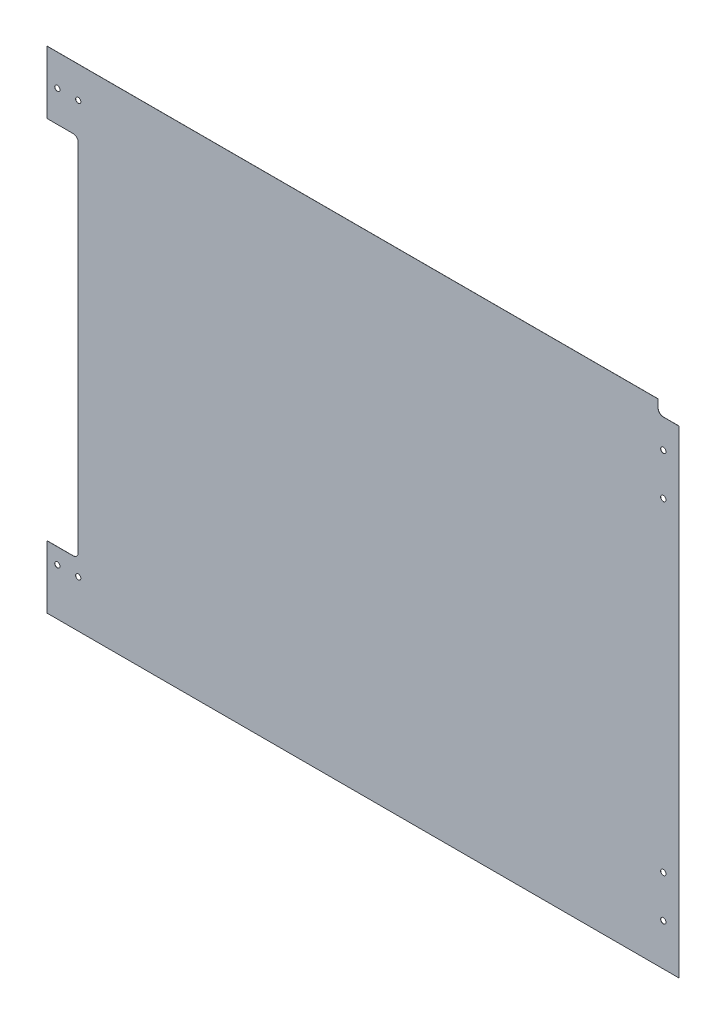
ISO-10303-21;
HEADER;
FILE_DESCRIPTION(('STEP AP214'),'2;1');
FILE_NAME('part.step','',(''),(''),'','','');
FILE_SCHEMA(('AUTOMOTIVE_DESIGN { 1 0 10303 214 1 1 1 1 }'));
ENDSEC;
DATA;
#1=APPLICATION_CONTEXT('core data for automotive mechanical design processes');
#2=APPLICATION_PROTOCOL_DEFINITION('international standard','automotive_design',2000,#1);
#3=PRODUCT_CONTEXT('',#1,'mechanical');
#4=PRODUCT('Part','Part','',(#3));
#5=PRODUCT_RELATED_PRODUCT_CATEGORY('part','',(#4));
#6=PRODUCT_DEFINITION_FORMATION('','',#4);
#7=PRODUCT_DEFINITION_CONTEXT('part definition',#1,'design');
#8=PRODUCT_DEFINITION('design','',#6,#7);
#9=PRODUCT_DEFINITION_SHAPE('','',#8);
#10=(LENGTH_UNIT() NAMED_UNIT(*) SI_UNIT(.MILLI.,.METRE.));
#11=(NAMED_UNIT(*) PLANE_ANGLE_UNIT() SI_UNIT($,.RADIAN.));
#12=(NAMED_UNIT(*) SI_UNIT($,.STERADIAN.) SOLID_ANGLE_UNIT());
#13=UNCERTAINTY_MEASURE_WITH_UNIT(LENGTH_MEASURE(1.E-05),#10,'distance_accuracy_value','');
#14=(GEOMETRIC_REPRESENTATION_CONTEXT(3) GLOBAL_UNCERTAINTY_ASSIGNED_CONTEXT((#13)) GLOBAL_UNIT_ASSIGNED_CONTEXT((#10,
#11,#12)) REPRESENTATION_CONTEXT('',''));
#15=CARTESIAN_POINT('',(0.,0.,0.));
#16=DIRECTION('',(0.,0.,1.));
#17=DIRECTION('',(1.,0.,0.));
#18=AXIS2_PLACEMENT_3D('',#15,#16,#17);
#19=CARTESIAN_POINT('',(0.,0.,0.127));
#20=DIRECTION('',(0.,0.,-1.));
#21=DIRECTION('',(-1.,0.,0.));
#22=AXIS2_PLACEMENT_3D('',#19,#20,#21);
#23=PLANE('',#22);
#24=CARTESIAN_POINT('',(-387.35,260.35,0.127000000000001));
#25=DIRECTION('',(0.,0.,1.));
#26=DIRECTION('',(1.,0.,0.));
#27=AXIS2_PLACEMENT_3D('',#24,#25,#26);
#28=CIRCLE('',#27,3.17499999999998);
#29=CARTESIAN_POINT('',(-384.175,260.35,0.127000000000001));
#30=VERTEX_POINT('',#29);
#31=EDGE_CURVE('E160',#30,#30,#28,.T.);
#32=ORIENTED_EDGE('',*,*,#31,.F.);
#33=EDGE_LOOP('',(#32));
#34=FACE_BOUND('',#33,.T.);
#35=CARTESIAN_POINT('',(-387.35,-241.3,0.127000000000001));
#36=DIRECTION('',(0.,0.,1.));
#37=DIRECTION('',(1.,0.,0.));
#38=AXIS2_PLACEMENT_3D('',#35,#36,#37);
#39=CIRCLE('',#38,3.17499999999998);
#40=CARTESIAN_POINT('',(-384.175,-241.3,0.127000000000001));
#41=VERTEX_POINT('',#40);
#42=EDGE_CURVE('E180',#41,#41,#39,.T.);
#43=ORIENTED_EDGE('',*,*,#42,.F.);
#44=EDGE_LOOP('',(#43));
#45=FACE_BOUND('',#44,.T.);
#46=CARTESIAN_POINT('',(349.25,247.65,0.127));
#47=DIRECTION('',(0.,0.,1.));
#48=DIRECTION('',(1.,0.,0.));
#49=AXIS2_PLACEMENT_3D('',#46,#47,#48);
#50=CIRCLE('',#49,3.26389999999999);
#51=CARTESIAN_POINT('',(352.5139,247.65,0.127));
#52=VERTEX_POINT('',#51);
#53=EDGE_CURVE('E186',#52,#52,#50,.T.);
#54=ORIENTED_EDGE('',*,*,#53,.F.);
#55=EDGE_LOOP('',(#54));
#56=FACE_BOUND('',#55,.T.);
#57=CARTESIAN_POINT('',(349.25,196.85,0.127));
#58=DIRECTION('',(0.,0.,1.));
#59=DIRECTION('',(1.,0.,0.));
#60=AXIS2_PLACEMENT_3D('',#57,#58,#59);
#61=CIRCLE('',#60,3.26389999999999);
#62=CARTESIAN_POINT('',(352.5139,196.85,0.127));
#63=VERTEX_POINT('',#62);
#64=EDGE_CURVE('E192',#63,#63,#61,.T.);
#65=ORIENTED_EDGE('',*,*,#64,.F.);
#66=EDGE_LOOP('',(#65));
#67=FACE_BOUND('',#66,.T.);
#68=CARTESIAN_POINT('',(349.25,-196.85,0.127));
#69=DIRECTION('',(0.,0.,1.));
#70=DIRECTION('',(1.,0.,0.));
#71=AXIS2_PLACEMENT_3D('',#68,#69,#70);
#72=CIRCLE('',#71,3.26389999999999);
#73=CARTESIAN_POINT('',(352.5139,-196.85,0.127));
#74=VERTEX_POINT('',#73);
#75=EDGE_CURVE('E198',#74,#74,#72,.T.);
#76=ORIENTED_EDGE('',*,*,#75,.F.);
#77=EDGE_LOOP('',(#76));
#78=FACE_BOUND('',#77,.T.);
#79=CARTESIAN_POINT('',(349.25,-247.65,0.127));
#80=DIRECTION('',(0.,0.,1.));
#81=DIRECTION('',(1.,0.,0.));
#82=AXIS2_PLACEMENT_3D('',#79,#80,#81);
#83=CIRCLE('',#82,3.26389999999999);
#84=CARTESIAN_POINT('',(352.5139,-247.65,0.127));
#85=VERTEX_POINT('',#84);
#86=EDGE_CURVE('E204',#85,#85,#83,.T.);
#87=ORIENTED_EDGE('',*,*,#86,.F.);
#88=EDGE_LOOP('',(#87));
#89=FACE_BOUND('',#88,.T.);
#90=DIRECTION('',(0.,1.,0.));
#91=VECTOR('',#90,1.);
#92=CARTESIAN_POINT('',(368.3,-298.45,0.127));
#93=LINE('',#92,#91);
#94=CARTESIAN_POINT('',(368.3,-298.45,0.127));
#95=VERTEX_POINT('',#94);
#96=CARTESIAN_POINT('',(368.3,282.575,0.127));
#97=VERTEX_POINT('',#96);
#98=EDGE_CURVE('E250',#95,#97,#93,.T.);
#99=ORIENTED_EDGE('',*,*,#98,.T.);
#100=DIRECTION('',(1.,0.,0.));
#101=VECTOR('',#100,1.);
#102=CARTESIAN_POINT('',(368.3,282.575,0.127));
#103=LINE('',#102,#101);
#104=CARTESIAN_POINT('',(349.25,282.575,0.127));
#105=VERTEX_POINT('',#104);
#106=EDGE_CURVE('E149',#105,#97,#103,.T.);
#107=ORIENTED_EDGE('',*,*,#106,.F.);
#108=CARTESIAN_POINT('',(349.25,288.925,0.127));
#109=DIRECTION('',(0.,0.,1.));
#110=DIRECTION('',(-1.,0.,0.));
#111=AXIS2_PLACEMENT_3D('',#108,#109,#110);
#112=CIRCLE('',#111,6.35000000000002);
#113=CARTESIAN_POINT('',(342.9,288.925,0.127));
#114=VERTEX_POINT('',#113);
#115=EDGE_CURVE('E151',#114,#105,#112,.T.);
#116=ORIENTED_EDGE('',*,*,#115,.F.);
#117=DIRECTION('',(0.,-1.,0.));
#118=VECTOR('',#117,1.);
#119=CARTESIAN_POINT('',(342.9,298.45,0.127));
#120=LINE('',#119,#118);
#121=CARTESIAN_POINT('',(342.9,298.45,0.127));
#122=VERTEX_POINT('',#121);
#123=EDGE_CURVE('E129',#122,#114,#120,.T.);
#124=ORIENTED_EDGE('',*,*,#123,.F.);
#125=DIRECTION('',(-1.,0.,0.));
#126=VECTOR('',#125,1.);
#127=CARTESIAN_POINT('',(-368.3,298.45,0.127));
#128=LINE('',#127,#126);
#129=CARTESIAN_POINT('',(-400.05,298.45,0.127));
#130=VERTEX_POINT('',#129);
#131=EDGE_CURVE('E253',#122,#130,#128,.T.);
#132=ORIENTED_EDGE('',*,*,#131,.T.);
#133=DIRECTION('',(0.,-1.,0.));
#134=VECTOR('',#133,1.);
#135=CARTESIAN_POINT('',(-400.05,298.45,0.127));
#136=LINE('',#135,#134);
#137=CARTESIAN_POINT('',(-400.05,222.25,0.127));
#138=VERTEX_POINT('',#137);
#139=EDGE_CURVE('E230',#130,#138,#136,.T.);
#140=ORIENTED_EDGE('',*,*,#139,.T.);
#141=DIRECTION('',(1.,0.,0.));
#142=VECTOR('',#141,1.);
#143=CARTESIAN_POINT('',(-368.3,222.25,0.127));
#144=LINE('',#143,#142);
#145=CARTESIAN_POINT('',(-368.3,222.25,0.127));
#146=VERTEX_POINT('',#145);
#147=EDGE_CURVE('E233',#138,#146,#144,.T.);
#148=ORIENTED_EDGE('',*,*,#147,.T.);
#149=CARTESIAN_POINT('',(-368.3,215.9,0.127000000000002));
#150=DIRECTION('',(0.,0.,-1.));
#151=DIRECTION('',(-1.,0.,0.));
#152=AXIS2_PLACEMENT_3D('',#149,#150,#151);
#153=CIRCLE('',#152,6.35);
#154=CARTESIAN_POINT('',(-361.95,215.9,0.127));
#155=VERTEX_POINT('',#154);
#156=EDGE_CURVE('E274',#146,#155,#153,.T.);
#157=ORIENTED_EDGE('',*,*,#156,.T.);
#158=DIRECTION('',(0.,1.,0.));
#159=VECTOR('',#158,1.);
#160=CARTESIAN_POINT('',(-361.95,222.25,0.127));
#161=LINE('',#160,#159);
#162=CARTESIAN_POINT('',(-361.95,-215.9,0.127));
#163=VERTEX_POINT('',#162);
#164=EDGE_CURVE('E210',#163,#155,#161,.T.);
#165=ORIENTED_EDGE('',*,*,#164,.F.);
#166=CARTESIAN_POINT('',(-368.3,-215.9,0.127));
#167=DIRECTION('',(0.,0.,-1.));
#168=DIRECTION('',(-1.,0.,0.));
#169=AXIS2_PLACEMENT_3D('',#166,#167,#168);
#170=CIRCLE('',#169,6.35);
#171=CARTESIAN_POINT('',(-368.3,-222.25,0.127));
#172=VERTEX_POINT('',#171);
#173=EDGE_CURVE('E40',#163,#172,#170,.T.);
#174=ORIENTED_EDGE('',*,*,#173,.T.);
#175=DIRECTION('',(-1.,0.,0.));
#176=VECTOR('',#175,1.);
#177=CARTESIAN_POINT('',(-368.3,-222.25,0.127));
#178=LINE('',#177,#176);
#179=CARTESIAN_POINT('',(-400.05,-222.25,0.127));
#180=VERTEX_POINT('',#179);
#181=EDGE_CURVE('E214',#172,#180,#178,.T.);
#182=ORIENTED_EDGE('',*,*,#181,.T.);
#183=DIRECTION('',(0.,-1.,0.));
#184=VECTOR('',#183,1.);
#185=CARTESIAN_POINT('',(-400.05,-298.45,0.127));
#186=LINE('',#185,#184);
#187=CARTESIAN_POINT('',(-400.05,-298.45,0.127));
#188=VERTEX_POINT('',#187);
#189=EDGE_CURVE('E217',#180,#188,#186,.T.);
#190=ORIENTED_EDGE('',*,*,#189,.T.);
#191=DIRECTION('',(1.,0.,0.));
#192=VECTOR('',#191,1.);
#193=CARTESIAN_POINT('',(-368.3,-298.45,0.127));
#194=LINE('',#193,#192);
#195=EDGE_CURVE('E256',#188,#95,#194,.T.);
#196=ORIENTED_EDGE('',*,*,#195,.T.);
#197=EDGE_LOOP('',(#99,#107,#116,#124,#132,#140,#148,#157,#165,#174,#182,#190,#196));
#198=FACE_BOUND('',#197,.T.);
#199=CARTESIAN_POINT('',(-361.95,-241.3,0.127000000000001));
#200=DIRECTION('',(0.,0.,1.));
#201=DIRECTION('',(1.,0.,0.));
#202=AXIS2_PLACEMENT_3D('',#199,#200,#201);
#203=CIRCLE('',#202,3.17499999999998);
#204=CARTESIAN_POINT('',(-358.775,-241.3,0.127000000000001));
#205=VERTEX_POINT('',#204);
#206=EDGE_CURVE('E174',#205,#205,#203,.T.);
#207=ORIENTED_EDGE('',*,*,#206,.F.);
#208=EDGE_LOOP('',(#207));
#209=FACE_BOUND('',#208,.T.);
#210=CARTESIAN_POINT('',(-361.95,260.35,0.127000000000001));
#211=DIRECTION('',(0.,0.,1.));
#212=DIRECTION('',(1.,0.,0.));
#213=AXIS2_PLACEMENT_3D('',#210,#211,#212);
#214=CIRCLE('',#213,3.17499999999998);
#215=CARTESIAN_POINT('',(-358.775,260.35,0.127000000000001));
#216=VERTEX_POINT('',#215);
#217=EDGE_CURVE('E168',#216,#216,#214,.T.);
#218=ORIENTED_EDGE('',*,*,#217,.F.);
#219=EDGE_LOOP('',(#218));
#220=FACE_BOUND('',#219,.T.);
#221=ADVANCED_FACE('F32',(#34,#45,#56,#67,#78,#89,#198,#209,#220),#23,.F.);
#222=CARTESIAN_POINT('',(0.,0.,0.));
#223=DIRECTION('',(0.,0.,-1.));
#224=DIRECTION('',(-1.,0.,0.));
#225=AXIS2_PLACEMENT_3D('',#222,#223,#224);
#226=PLANE('',#225);
#227=DIRECTION('',(1.,0.,0.));
#228=VECTOR('',#227,1.);
#229=CARTESIAN_POINT('',(368.3,282.575,0.));
#230=LINE('',#229,#228);
#231=CARTESIAN_POINT('',(349.25,282.575,0.));
#232=VERTEX_POINT('',#231);
#233=CARTESIAN_POINT('',(368.3,282.575,0.));
#234=VERTEX_POINT('',#233);
#235=EDGE_CURVE('E142',#232,#234,#230,.T.);
#236=ORIENTED_EDGE('',*,*,#235,.T.);
#237=DIRECTION('',(0.,1.,0.));
#238=VECTOR('',#237,1.);
#239=CARTESIAN_POINT('',(368.3,-298.45,0.));
#240=LINE('',#239,#238);
#241=CARTESIAN_POINT('',(368.3,-298.45,0.));
#242=VERTEX_POINT('',#241);
#243=EDGE_CURVE('E242',#242,#234,#240,.T.);
#244=ORIENTED_EDGE('',*,*,#243,.F.);
#245=DIRECTION('',(1.,0.,0.));
#246=VECTOR('',#245,1.);
#247=CARTESIAN_POINT('',(-368.3,-298.45,0.));
#248=LINE('',#247,#246);
#249=CARTESIAN_POINT('',(-400.05,-298.45,0.));
#250=VERTEX_POINT('',#249);
#251=EDGE_CURVE('E254',#250,#242,#248,.T.);
#252=ORIENTED_EDGE('',*,*,#251,.F.);
#253=DIRECTION('',(0.,-1.,0.));
#254=VECTOR('',#253,1.);
#255=CARTESIAN_POINT('',(-400.05,-298.45,0.));
#256=LINE('',#255,#254);
#257=CARTESIAN_POINT('',(-400.05,-222.25,0.));
#258=VERTEX_POINT('',#257);
#259=EDGE_CURVE('E224',#258,#250,#256,.T.);
#260=ORIENTED_EDGE('',*,*,#259,.F.);
#261=DIRECTION('',(-1.,0.,0.));
#262=VECTOR('',#261,1.);
#263=CARTESIAN_POINT('',(-368.3,-222.25,0.));
#264=LINE('',#263,#262);
#265=CARTESIAN_POINT('',(-368.3,-222.25,0.));
#266=VERTEX_POINT('',#265);
#267=EDGE_CURVE('E220',#266,#258,#264,.T.);
#268=ORIENTED_EDGE('',*,*,#267,.F.);
#269=CARTESIAN_POINT('',(-368.3,-215.9,0.));
#270=DIRECTION('',(0.,0.,-1.));
#271=DIRECTION('',(-1.,0.,0.));
#272=AXIS2_PLACEMENT_3D('',#269,#270,#271);
#273=CIRCLE('',#272,6.35);
#274=CARTESIAN_POINT('',(-361.95,-215.9,0.));
#275=VERTEX_POINT('',#274);
#276=EDGE_CURVE('E11',#266,#275,#273,.F.);
#277=ORIENTED_EDGE('',*,*,#276,.T.);
#278=DIRECTION('',(0.,1.,0.));
#279=VECTOR('',#278,1.);
#280=CARTESIAN_POINT('',(-361.95,222.25,0.));
#281=LINE('',#280,#279);
#282=CARTESIAN_POINT('',(-361.95,215.9,0.));
#283=VERTEX_POINT('',#282);
#284=EDGE_CURVE('E211',#275,#283,#281,.T.);
#285=ORIENTED_EDGE('',*,*,#284,.T.);
#286=CARTESIAN_POINT('',(-368.3,215.9,0.));
#287=DIRECTION('',(0.,0.,-1.));
#288=DIRECTION('',(-1.,0.,0.));
#289=AXIS2_PLACEMENT_3D('',#286,#287,#288);
#290=CIRCLE('',#289,6.35);
#291=CARTESIAN_POINT('',(-368.3,222.25,0.));
#292=VERTEX_POINT('',#291);
#293=EDGE_CURVE('E276',#283,#292,#290,.F.);
#294=ORIENTED_EDGE('',*,*,#293,.T.);
#295=DIRECTION('',(1.,0.,0.));
#296=VECTOR('',#295,1.);
#297=CARTESIAN_POINT('',(-368.3,222.25,0.));
#298=LINE('',#297,#296);
#299=CARTESIAN_POINT('',(-400.05,222.25,0.));
#300=VERTEX_POINT('',#299);
#301=EDGE_CURVE('E239',#300,#292,#298,.T.);
#302=ORIENTED_EDGE('',*,*,#301,.F.);
#303=DIRECTION('',(0.,-1.,0.));
#304=VECTOR('',#303,1.);
#305=CARTESIAN_POINT('',(-400.05,298.45,0.));
#306=LINE('',#305,#304);
#307=CARTESIAN_POINT('',(-400.05,298.45,0.));
#308=VERTEX_POINT('',#307);
#309=EDGE_CURVE('E244',#308,#300,#306,.T.);
#310=ORIENTED_EDGE('',*,*,#309,.F.);
#311=DIRECTION('',(-1.,0.,0.));
#312=VECTOR('',#311,1.);
#313=CARTESIAN_POINT('',(-368.3,298.45,0.));
#314=LINE('',#313,#312);
#315=CARTESIAN_POINT('',(342.9,298.45,0.));
#316=VERTEX_POINT('',#315);
#317=EDGE_CURVE('E148',#316,#308,#314,.T.);
#318=ORIENTED_EDGE('',*,*,#317,.F.);
#319=DIRECTION('',(0.,-1.,0.));
#320=VECTOR('',#319,1.);
#321=CARTESIAN_POINT('',(342.9,298.45,0.));
#322=LINE('',#321,#320);
#323=CARTESIAN_POINT('',(342.9,288.925,0.));
#324=VERTEX_POINT('',#323);
#325=EDGE_CURVE('E47',#316,#324,#322,.T.);
#326=ORIENTED_EDGE('',*,*,#325,.T.);
#327=CARTESIAN_POINT('',(349.25,288.925,0.));
#328=DIRECTION('',(0.,0.,1.));
#329=DIRECTION('',(-1.,0.,0.));
#330=AXIS2_PLACEMENT_3D('',#327,#328,#329);
#331=CIRCLE('',#330,6.35000000000002);
#332=EDGE_CURVE('E137',#324,#232,#331,.T.);
#333=ORIENTED_EDGE('',*,*,#332,.T.);
#334=EDGE_LOOP('',(#236,#244,#252,#260,#268,#277,#285,#294,#302,#310,#318,#326,#333));
#335=FACE_BOUND('',#334,.T.);
#336=CARTESIAN_POINT('',(-387.35,260.35,0.));
#337=DIRECTION('',(0.,0.,-1.));
#338=DIRECTION('',(-1.,0.,0.));
#339=AXIS2_PLACEMENT_3D('',#336,#337,#338);
#340=CIRCLE('',#339,3.17499999999998);
#341=CARTESIAN_POINT('',(-390.525,260.35,0.));
#342=VERTEX_POINT('',#341);
#343=EDGE_CURVE('E165',#342,#342,#340,.F.);
#344=ORIENTED_EDGE('',*,*,#343,.T.);
#345=EDGE_LOOP('',(#344));
#346=FACE_BOUND('',#345,.T.);
#347=CARTESIAN_POINT('',(-361.95,260.35,0.));
#348=DIRECTION('',(0.,0.,-1.));
#349=DIRECTION('',(-1.,0.,0.));
#350=AXIS2_PLACEMENT_3D('',#347,#348,#349);
#351=CIRCLE('',#350,3.17499999999998);
#352=CARTESIAN_POINT('',(-365.125,260.35,0.));
#353=VERTEX_POINT('',#352);
#354=EDGE_CURVE('E171',#353,#353,#351,.F.);
#355=ORIENTED_EDGE('',*,*,#354,.T.);
#356=EDGE_LOOP('',(#355));
#357=FACE_BOUND('',#356,.T.);
#358=CARTESIAN_POINT('',(-361.95,-241.3,0.));
#359=DIRECTION('',(0.,0.,-1.));
#360=DIRECTION('',(-1.,0.,0.));
#361=AXIS2_PLACEMENT_3D('',#358,#359,#360);
#362=CIRCLE('',#361,3.17499999999998);
#363=CARTESIAN_POINT('',(-365.125,-241.3,0.));
#364=VERTEX_POINT('',#363);
#365=EDGE_CURVE('E177',#364,#364,#362,.F.);
#366=ORIENTED_EDGE('',*,*,#365,.T.);
#367=EDGE_LOOP('',(#366));
#368=FACE_BOUND('',#367,.T.);
#369=CARTESIAN_POINT('',(-387.35,-241.3,0.));
#370=DIRECTION('',(0.,0.,-1.));
#371=DIRECTION('',(-1.,0.,0.));
#372=AXIS2_PLACEMENT_3D('',#369,#370,#371);
#373=CIRCLE('',#372,3.17499999999998);
#374=CARTESIAN_POINT('',(-390.525,-241.3,0.));
#375=VERTEX_POINT('',#374);
#376=EDGE_CURVE('E183',#375,#375,#373,.F.);
#377=ORIENTED_EDGE('',*,*,#376,.T.);
#378=EDGE_LOOP('',(#377));
#379=FACE_BOUND('',#378,.T.);
#380=CARTESIAN_POINT('',(349.25,247.65,0.));
#381=DIRECTION('',(0.,0.,1.));
#382=DIRECTION('',(1.,0.,0.));
#383=AXIS2_PLACEMENT_3D('',#380,#381,#382);
#384=CIRCLE('',#383,3.26389999999999);
#385=CARTESIAN_POINT('',(352.5139,247.65,0.));
#386=VERTEX_POINT('',#385);
#387=EDGE_CURVE('E189',#386,#386,#384,.T.);
#388=ORIENTED_EDGE('',*,*,#387,.T.);
#389=EDGE_LOOP('',(#388));
#390=FACE_BOUND('',#389,.T.);
#391=CARTESIAN_POINT('',(349.25,196.85,0.));
#392=DIRECTION('',(0.,0.,1.));
#393=DIRECTION('',(1.,0.,0.));
#394=AXIS2_PLACEMENT_3D('',#391,#392,#393);
#395=CIRCLE('',#394,3.26389999999999);
#396=CARTESIAN_POINT('',(352.5139,196.85,0.));
#397=VERTEX_POINT('',#396);
#398=EDGE_CURVE('E195',#397,#397,#395,.T.);
#399=ORIENTED_EDGE('',*,*,#398,.T.);
#400=EDGE_LOOP('',(#399));
#401=FACE_BOUND('',#400,.T.);
#402=CARTESIAN_POINT('',(349.25,-247.65,0.));
#403=DIRECTION('',(0.,0.,1.));
#404=DIRECTION('',(1.,0.,0.));
#405=AXIS2_PLACEMENT_3D('',#402,#403,#404);
#406=CIRCLE('',#405,3.26389999999999);
#407=CARTESIAN_POINT('',(352.5139,-247.65,0.));
#408=VERTEX_POINT('',#407);
#409=EDGE_CURVE('E207',#408,#408,#406,.T.);
#410=ORIENTED_EDGE('',*,*,#409,.T.);
#411=EDGE_LOOP('',(#410));
#412=FACE_BOUND('',#411,.T.);
#413=CARTESIAN_POINT('',(349.25,-196.85,0.));
#414=DIRECTION('',(0.,0.,1.));
#415=DIRECTION('',(1.,0.,0.));
#416=AXIS2_PLACEMENT_3D('',#413,#414,#415);
#417=CIRCLE('',#416,3.26389999999999);
#418=CARTESIAN_POINT('',(352.5139,-196.85,0.));
#419=VERTEX_POINT('',#418);
#420=EDGE_CURVE('E201',#419,#419,#417,.T.);
#421=ORIENTED_EDGE('',*,*,#420,.T.);
#422=EDGE_LOOP('',(#421));
#423=FACE_BOUND('',#422,.T.);
#424=ADVANCED_FACE('F145',(#335,#346,#357,#368,#379,#390,#401,#412,#423),#226,.T.);
#425=CARTESIAN_POINT('',(368.3,-298.45,0.127));
#426=DIRECTION('',(-1.,0.,0.));
#427=DIRECTION('',(0.,0.,1.));
#428=AXIS2_PLACEMENT_3D('',#425,#426,#427);
#429=PLANE('',#428);
#430=ORIENTED_EDGE('',*,*,#243,.T.);
#431=DIRECTION('',(0.,0.,1.));
#432=VECTOR('',#431,1.);
#433=CARTESIAN_POINT('',(368.3,282.575,0.));
#434=LINE('',#433,#432);
#435=EDGE_CURVE('E157',#234,#97,#434,.T.);
#436=ORIENTED_EDGE('',*,*,#435,.T.);
#437=ORIENTED_EDGE('',*,*,#98,.F.);
#438=DIRECTION('',(0.,0.,-1.));
#439=VECTOR('',#438,1.);
#440=CARTESIAN_POINT('',(368.3,-298.45,0.127));
#441=LINE('',#440,#439);
#442=EDGE_CURVE('E258',#95,#242,#441,.T.);
#443=ORIENTED_EDGE('',*,*,#442,.T.);
#444=EDGE_LOOP('',(#430,#436,#437,#443));
#445=FACE_BOUND('',#444,.T.);
#446=ADVANCED_FACE('F311',(#445),#429,.F.);
#447=CARTESIAN_POINT('',(-368.3,298.45,0.127));
#448=DIRECTION('',(0.,-1.,0.));
#449=DIRECTION('',(0.,0.,-1.));
#450=AXIS2_PLACEMENT_3D('',#447,#448,#449);
#451=PLANE('',#450);
#452=ORIENTED_EDGE('',*,*,#131,.F.);
#453=DIRECTION('',(0.,0.,1.));
#454=VECTOR('',#453,1.);
#455=CARTESIAN_POINT('',(342.9,298.45,0.));
#456=LINE('',#455,#454);
#457=EDGE_CURVE('E134',#316,#122,#456,.T.);
#458=ORIENTED_EDGE('',*,*,#457,.F.);
#459=ORIENTED_EDGE('',*,*,#317,.T.);
#460=DIRECTION('',(0.,0.,1.));
#461=VECTOR('',#460,1.);
#462=CARTESIAN_POINT('',(-400.05,298.45,-82.55));
#463=LINE('',#462,#461);
#464=EDGE_CURVE('E236',#308,#130,#463,.T.);
#465=ORIENTED_EDGE('',*,*,#464,.T.);
#466=EDGE_LOOP('',(#452,#458,#459,#465));
#467=FACE_BOUND('',#466,.T.);
#468=ADVANCED_FACE('F305',(#467),#451,.F.);
#469=CARTESIAN_POINT('',(-368.3,-298.45,0.127));
#470=DIRECTION('',(0.,1.,0.));
#471=DIRECTION('',(0.,0.,1.));
#472=AXIS2_PLACEMENT_3D('',#469,#470,#471);
#473=PLANE('',#472);
#474=ORIENTED_EDGE('',*,*,#251,.T.);
#475=ORIENTED_EDGE('',*,*,#442,.F.);
#476=ORIENTED_EDGE('',*,*,#195,.F.);
#477=DIRECTION('',(0.,0.,1.));
#478=VECTOR('',#477,1.);
#479=CARTESIAN_POINT('',(-400.05,-298.45,-82.55));
#480=LINE('',#479,#478);
#481=EDGE_CURVE('E227',#250,#188,#480,.T.);
#482=ORIENTED_EDGE('',*,*,#481,.F.);
#483=EDGE_LOOP('',(#474,#475,#476,#482));
#484=FACE_BOUND('',#483,.T.);
#485=ADVANCED_FACE('F316',(#484),#473,.F.);
#486=CARTESIAN_POINT('',(-400.05,298.45,-82.55));
#487=DIRECTION('',(-1.,0.,0.));
#488=DIRECTION('',(0.,-1.,0.));
#489=AXIS2_PLACEMENT_3D('',#486,#487,#488);
#490=PLANE('',#489);
#491=ORIENTED_EDGE('',*,*,#464,.F.);
#492=ORIENTED_EDGE('',*,*,#309,.T.);
#493=DIRECTION('',(0.,0.,1.));
#494=VECTOR('',#493,1.);
#495=CARTESIAN_POINT('',(-400.05,222.25,-82.55));
#496=LINE('',#495,#494);
#497=EDGE_CURVE('E243',#300,#138,#496,.T.);
#498=ORIENTED_EDGE('',*,*,#497,.T.);
#499=ORIENTED_EDGE('',*,*,#139,.F.);
#500=EDGE_LOOP('',(#491,#492,#498,#499));
#501=FACE_BOUND('',#500,.T.);
#502=ADVANCED_FACE('F302',(#501),#490,.T.);
#503=CARTESIAN_POINT('',(-368.3,222.25,-82.55));
#504=DIRECTION('',(0.,-1.,0.));
#505=DIRECTION('',(0.,0.,-1.));
#506=AXIS2_PLACEMENT_3D('',#503,#504,#505);
#507=PLANE('',#506);
#508=ORIENTED_EDGE('',*,*,#301,.T.);
#509=DIRECTION('',(0.,0.,1.));
#510=VECTOR('',#509,1.);
#511=CARTESIAN_POINT('',(-368.3,222.25,-82.55));
#512=LINE('',#511,#510);
#513=EDGE_CURVE('E265',#292,#146,#512,.T.);
#514=ORIENTED_EDGE('',*,*,#513,.T.);
#515=ORIENTED_EDGE('',*,*,#147,.F.);
#516=ORIENTED_EDGE('',*,*,#497,.F.);
#517=EDGE_LOOP('',(#508,#514,#515,#516));
#518=FACE_BOUND('',#517,.T.);
#519=ADVANCED_FACE('F297',(#518),#507,.T.);
#520=CARTESIAN_POINT('',(-368.3,-222.25,-82.55));
#521=DIRECTION('',(0.,1.,0.));
#522=DIRECTION('',(0.,0.,1.));
#523=AXIS2_PLACEMENT_3D('',#520,#521,#522);
#524=PLANE('',#523);
#525=ORIENTED_EDGE('',*,*,#181,.F.);
#526=DIRECTION('',(0.,0.,1.));
#527=VECTOR('',#526,1.);
#528=CARTESIAN_POINT('',(-368.3,-222.25,-82.55));
#529=LINE('',#528,#527);
#530=EDGE_CURVE('E55',#172,#266,#529,.F.);
#531=ORIENTED_EDGE('',*,*,#530,.T.);
#532=ORIENTED_EDGE('',*,*,#267,.T.);
#533=DIRECTION('',(0.,0.,1.));
#534=VECTOR('',#533,1.);
#535=CARTESIAN_POINT('',(-400.05,-222.25,-82.55));
#536=LINE('',#535,#534);
#537=EDGE_CURVE('E223',#258,#180,#536,.T.);
#538=ORIENTED_EDGE('',*,*,#537,.T.);
#539=EDGE_LOOP('',(#525,#531,#532,#538));
#540=FACE_BOUND('',#539,.T.);
#541=ADVANCED_FACE('F282',(#540),#524,.T.);
#542=CARTESIAN_POINT('',(-400.05,-298.45,-82.55));
#543=DIRECTION('',(-1.,0.,0.));
#544=DIRECTION('',(0.,0.,1.));
#545=AXIS2_PLACEMENT_3D('',#542,#543,#544);
#546=PLANE('',#545);
#547=ORIENTED_EDGE('',*,*,#537,.F.);
#548=ORIENTED_EDGE('',*,*,#259,.T.);
#549=ORIENTED_EDGE('',*,*,#481,.T.);
#550=ORIENTED_EDGE('',*,*,#189,.F.);
#551=EDGE_LOOP('',(#547,#548,#549,#550));
#552=FACE_BOUND('',#551,.T.);
#553=ADVANCED_FACE('F318',(#552),#546,.T.);
#554=CARTESIAN_POINT('',(-361.95,222.25,0.));
#555=DIRECTION('',(1.,0.,0.));
#556=DIRECTION('',(0.,1.,0.));
#557=AXIS2_PLACEMENT_3D('',#554,#555,#556);
#558=PLANE('',#557);
#559=ORIENTED_EDGE('',*,*,#164,.T.);
#560=DIRECTION('',(0.,0.,1.));
#561=VECTOR('',#560,1.);
#562=CARTESIAN_POINT('',(-361.95,215.9,0.));
#563=LINE('',#562,#561);
#564=EDGE_CURVE('E271',#155,#283,#563,.F.);
#565=ORIENTED_EDGE('',*,*,#564,.T.);
#566=ORIENTED_EDGE('',*,*,#284,.F.);
#567=DIRECTION('',(0.,0.,1.));
#568=VECTOR('',#567,1.);
#569=CARTESIAN_POINT('',(-361.95,-215.9,0.));
#570=LINE('',#569,#568);
#571=EDGE_CURVE('E268',#275,#163,#570,.T.);
#572=ORIENTED_EDGE('',*,*,#571,.T.);
#573=EDGE_LOOP('',(#559,#565,#566,#572));
#574=FACE_BOUND('',#573,.T.);
#575=ADVANCED_FACE('F290',(#574),#558,.F.);
#576=CARTESIAN_POINT('',(-368.3,215.9,-82.55));
#577=DIRECTION('',(0.,0.,1.));
#578=DIRECTION('',(1.,0.,0.));
#579=AXIS2_PLACEMENT_3D('',#576,#577,#578);
#580=CYLINDRICAL_SURFACE('',#579,6.35);
#581=ORIENTED_EDGE('',*,*,#293,.F.);
#582=ORIENTED_EDGE('',*,*,#564,.F.);
#583=ORIENTED_EDGE('',*,*,#156,.F.);
#584=ORIENTED_EDGE('',*,*,#513,.F.);
#585=EDGE_LOOP('',(#581,#582,#583,#584));
#586=FACE_BOUND('',#585,.T.);
#587=ADVANCED_FACE('F293',(#586),#580,.F.);
#588=CARTESIAN_POINT('',(-368.3,-215.9,0.));
#589=DIRECTION('',(0.,0.,1.));
#590=DIRECTION('',(1.,0.,0.));
#591=AXIS2_PLACEMENT_3D('',#588,#589,#590);
#592=CYLINDRICAL_SURFACE('',#591,6.35);
#593=ORIENTED_EDGE('',*,*,#276,.F.);
#594=ORIENTED_EDGE('',*,*,#530,.F.);
#595=ORIENTED_EDGE('',*,*,#173,.F.);
#596=ORIENTED_EDGE('',*,*,#571,.F.);
#597=EDGE_LOOP('',(#593,#594,#595,#596));
#598=FACE_BOUND('',#597,.T.);
#599=ADVANCED_FACE('F34',(#598),#592,.F.);
#600=CARTESIAN_POINT('',(349.25,-247.65,0.127));
#601=DIRECTION('',(0.,0.,1.));
#602=DIRECTION('',(1.,0.,0.));
#603=AXIS2_PLACEMENT_3D('',#600,#601,#602);
#604=CYLINDRICAL_SURFACE('',#603,3.26389999999999);
#605=ORIENTED_EDGE('',*,*,#409,.F.);
#606=EDGE_LOOP('',(#605));
#607=FACE_BOUND('',#606,.T.);
#608=ORIENTED_EDGE('',*,*,#86,.T.);
#609=EDGE_LOOP('',(#608));
#610=FACE_BOUND('',#609,.T.);
#611=ADVANCED_FACE('F348',(#607,#610),#604,.F.);
#612=CARTESIAN_POINT('',(349.25,-196.85,0.127));
#613=DIRECTION('',(0.,0.,1.));
#614=DIRECTION('',(1.,0.,0.));
#615=AXIS2_PLACEMENT_3D('',#612,#613,#614);
#616=CYLINDRICAL_SURFACE('',#615,3.26389999999999);
#617=ORIENTED_EDGE('',*,*,#420,.F.);
#618=EDGE_LOOP('',(#617));
#619=FACE_BOUND('',#618,.T.);
#620=ORIENTED_EDGE('',*,*,#75,.T.);
#621=EDGE_LOOP('',(#620));
#622=FACE_BOUND('',#621,.T.);
#623=ADVANCED_FACE('F352',(#619,#622),#616,.F.);
#624=CARTESIAN_POINT('',(349.25,196.85,0.127));
#625=DIRECTION('',(0.,0.,1.));
#626=DIRECTION('',(1.,0.,0.));
#627=AXIS2_PLACEMENT_3D('',#624,#625,#626);
#628=CYLINDRICAL_SURFACE('',#627,3.26389999999999);
#629=ORIENTED_EDGE('',*,*,#398,.F.);
#630=EDGE_LOOP('',(#629));
#631=FACE_BOUND('',#630,.T.);
#632=ORIENTED_EDGE('',*,*,#64,.T.);
#633=EDGE_LOOP('',(#632));
#634=FACE_BOUND('',#633,.T.);
#635=ADVANCED_FACE('F358',(#631,#634),#628,.F.);
#636=CARTESIAN_POINT('',(349.25,247.65,0.127));
#637=DIRECTION('',(0.,0.,1.));
#638=DIRECTION('',(1.,0.,0.));
#639=AXIS2_PLACEMENT_3D('',#636,#637,#638);
#640=CYLINDRICAL_SURFACE('',#639,3.26389999999999);
#641=ORIENTED_EDGE('',*,*,#387,.F.);
#642=EDGE_LOOP('',(#641));
#643=FACE_BOUND('',#642,.T.);
#644=ORIENTED_EDGE('',*,*,#53,.T.);
#645=EDGE_LOOP('',(#644));
#646=FACE_BOUND('',#645,.T.);
#647=ADVANCED_FACE('F366',(#643,#646),#640,.F.);
#648=CARTESIAN_POINT('',(-387.35,-241.3,0.127));
#649=DIRECTION('',(0.,0.,1.));
#650=DIRECTION('',(1.,0.,0.));
#651=AXIS2_PLACEMENT_3D('',#648,#649,#650);
#652=CYLINDRICAL_SURFACE('',#651,3.17499999999998);
#653=ORIENTED_EDGE('',*,*,#376,.F.);
#654=EDGE_LOOP('',(#653));
#655=FACE_BOUND('',#654,.T.);
#656=ORIENTED_EDGE('',*,*,#42,.T.);
#657=EDGE_LOOP('',(#656));
#658=FACE_BOUND('',#657,.T.);
#659=ADVANCED_FACE('F370',(#655,#658),#652,.F.);
#660=CARTESIAN_POINT('',(-361.95,-241.3,0.127));
#661=DIRECTION('',(0.,0.,1.));
#662=DIRECTION('',(1.,0.,0.));
#663=AXIS2_PLACEMENT_3D('',#660,#661,#662);
#664=CYLINDRICAL_SURFACE('',#663,3.17499999999998);
#665=ORIENTED_EDGE('',*,*,#365,.F.);
#666=EDGE_LOOP('',(#665));
#667=FACE_BOUND('',#666,.T.);
#668=ORIENTED_EDGE('',*,*,#206,.T.);
#669=EDGE_LOOP('',(#668));
#670=FACE_BOUND('',#669,.T.);
#671=ADVANCED_FACE('F374',(#667,#670),#664,.F.);
#672=CARTESIAN_POINT('',(-361.95,260.35,0.127));
#673=DIRECTION('',(0.,0.,1.));
#674=DIRECTION('',(1.,0.,0.));
#675=AXIS2_PLACEMENT_3D('',#672,#673,#674);
#676=CYLINDRICAL_SURFACE('',#675,3.17499999999998);
#677=ORIENTED_EDGE('',*,*,#354,.F.);
#678=EDGE_LOOP('',(#677));
#679=FACE_BOUND('',#678,.T.);
#680=ORIENTED_EDGE('',*,*,#217,.T.);
#681=EDGE_LOOP('',(#680));
#682=FACE_BOUND('',#681,.T.);
#683=ADVANCED_FACE('F378',(#679,#682),#676,.F.);
#684=CARTESIAN_POINT('',(-387.35,260.35,0.127));
#685=DIRECTION('',(0.,0.,1.));
#686=DIRECTION('',(1.,0.,0.));
#687=AXIS2_PLACEMENT_3D('',#684,#685,#686);
#688=CYLINDRICAL_SURFACE('',#687,3.17499999999998);
#689=ORIENTED_EDGE('',*,*,#343,.F.);
#690=EDGE_LOOP('',(#689));
#691=FACE_BOUND('',#690,.T.);
#692=ORIENTED_EDGE('',*,*,#31,.T.);
#693=EDGE_LOOP('',(#692));
#694=FACE_BOUND('',#693,.T.);
#695=ADVANCED_FACE('F382',(#691,#694),#688,.F.);
#696=CARTESIAN_POINT('',(368.3,282.575,0.));
#697=DIRECTION('',(0.,-1.,0.));
#698=DIRECTION('',(0.,0.,-1.));
#699=AXIS2_PLACEMENT_3D('',#696,#697,#698);
#700=PLANE('',#699);
#701=ORIENTED_EDGE('',*,*,#106,.T.);
#702=ORIENTED_EDGE('',*,*,#435,.F.);
#703=ORIENTED_EDGE('',*,*,#235,.F.);
#704=DIRECTION('',(0.,0.,1.));
#705=VECTOR('',#704,1.);
#706=CARTESIAN_POINT('',(349.25,282.575,0.));
#707=LINE('',#706,#705);
#708=EDGE_CURVE('E133',#232,#105,#707,.T.);
#709=ORIENTED_EDGE('',*,*,#708,.T.);
#710=EDGE_LOOP('',(#701,#702,#703,#709));
#711=FACE_BOUND('',#710,.T.);
#712=ADVANCED_FACE('F309',(#711),#700,.F.);
#713=CARTESIAN_POINT('',(349.25,288.925,0.));
#714=DIRECTION('',(0.,0.,1.));
#715=DIRECTION('',(1.,0.,0.));
#716=AXIS2_PLACEMENT_3D('',#713,#714,#715);
#717=CYLINDRICAL_SURFACE('',#716,6.35000000000002);
#718=ORIENTED_EDGE('',*,*,#115,.T.);
#719=ORIENTED_EDGE('',*,*,#708,.F.);
#720=ORIENTED_EDGE('',*,*,#332,.F.);
#721=DIRECTION('',(0.,0.,1.));
#722=VECTOR('',#721,1.);
#723=CARTESIAN_POINT('',(342.9,288.925,0.));
#724=LINE('',#723,#722);
#725=EDGE_CURVE('E125',#324,#114,#724,.T.);
#726=ORIENTED_EDGE('',*,*,#725,.T.);
#727=EDGE_LOOP('',(#718,#719,#720,#726));
#728=FACE_BOUND('',#727,.T.);
#729=ADVANCED_FACE('F138',(#728),#717,.F.);
#730=CARTESIAN_POINT('',(342.9,298.45,0.));
#731=DIRECTION('',(-1.,0.,0.));
#732=DIRECTION('',(0.,0.,1.));
#733=AXIS2_PLACEMENT_3D('',#730,#731,#732);
#734=PLANE('',#733);
#735=ORIENTED_EDGE('',*,*,#123,.T.);
#736=ORIENTED_EDGE('',*,*,#725,.F.);
#737=ORIENTED_EDGE('',*,*,#325,.F.);
#738=ORIENTED_EDGE('',*,*,#457,.T.);
#739=EDGE_LOOP('',(#735,#736,#737,#738));
#740=FACE_BOUND('',#739,.T.);
#741=ADVANCED_FACE('F127',(#740),#734,.F.);
#742=CLOSED_SHELL('',(#221,#424,#446,#468,#485,#502,#519,#541,#553,#575,#587,#599,#611,#623,
#635,#647,#659,#671,#683,#695,#712,#729,#741));
#743=MANIFOLD_SOLID_BREP('B2',#742);
#744=ADVANCED_BREP_SHAPE_REPRESENTATION('',(#18,#743),#14);
#745=SHAPE_DEFINITION_REPRESENTATION(#9,#744);
ENDSEC;
END-ISO-10303-21;
